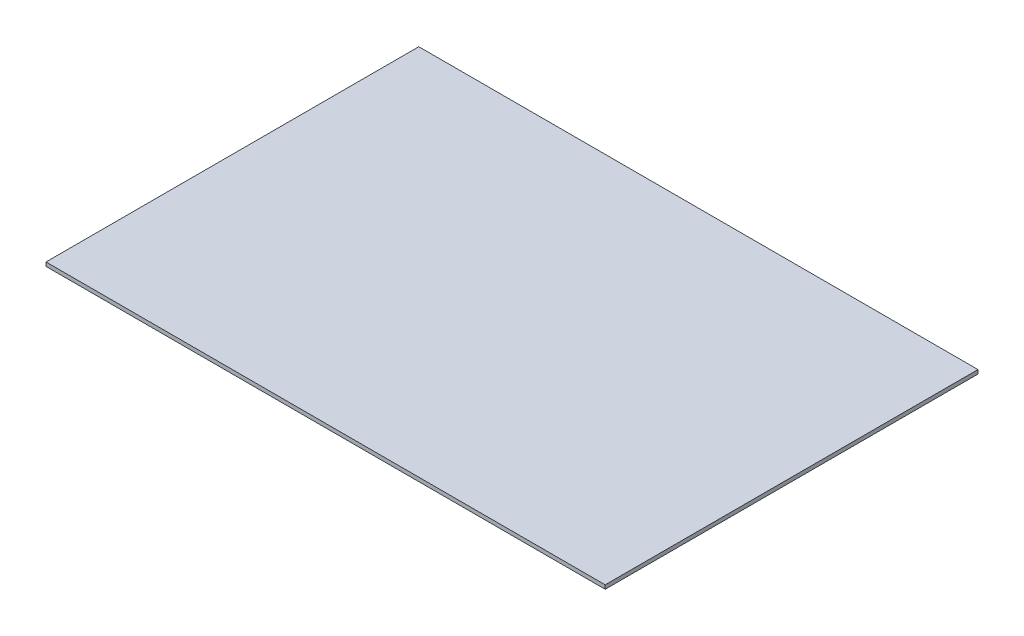
ISO-10303-21;
HEADER;
FILE_DESCRIPTION(('STEP AP214'),'2;1');
FILE_NAME('part.step','',(''),(''),'','','');
FILE_SCHEMA(('AUTOMOTIVE_DESIGN { 1 0 10303 214 1 1 1 1 }'));
ENDSEC;
DATA;
#1=APPLICATION_CONTEXT('core data for automotive mechanical design processes');
#2=APPLICATION_PROTOCOL_DEFINITION('international standard','automotive_design',2000,#1);
#3=PRODUCT_CONTEXT('',#1,'mechanical');
#4=PRODUCT('Part','Part','',(#3));
#5=PRODUCT_RELATED_PRODUCT_CATEGORY('part','',(#4));
#6=PRODUCT_DEFINITION_FORMATION('','',#4);
#7=PRODUCT_DEFINITION_CONTEXT('part definition',#1,'design');
#8=PRODUCT_DEFINITION('design','',#6,#7);
#9=PRODUCT_DEFINITION_SHAPE('','',#8);
#10=(LENGTH_UNIT() NAMED_UNIT(*) SI_UNIT(.MILLI.,.METRE.));
#11=(NAMED_UNIT(*) PLANE_ANGLE_UNIT() SI_UNIT($,.RADIAN.));
#12=(NAMED_UNIT(*) SI_UNIT($,.STERADIAN.) SOLID_ANGLE_UNIT());
#13=UNCERTAINTY_MEASURE_WITH_UNIT(LENGTH_MEASURE(1.E-05),#10,'distance_accuracy_value','');
#14=(GEOMETRIC_REPRESENTATION_CONTEXT(3) GLOBAL_UNCERTAINTY_ASSIGNED_CONTEXT((#13)) GLOBAL_UNIT_ASSIGNED_CONTEXT((#10,
#11,#12)) REPRESENTATION_CONTEXT('',''));
#15=CARTESIAN_POINT('',(0.,0.,0.));
#16=DIRECTION('',(0.,0.,1.));
#17=DIRECTION('',(1.,0.,0.));
#18=AXIS2_PLACEMENT_3D('',#15,#16,#17);
#19=CARTESIAN_POINT('',(228.6,3.175,152.4));
#20=DIRECTION('',(-1.,0.,0.));
#21=DIRECTION('',(0.,0.,1.));
#22=AXIS2_PLACEMENT_3D('',#19,#20,#21);
#23=PLANE('',#22);
#24=DIRECTION('',(0.,0.,-1.));
#25=VECTOR('',#24,1.);
#26=CARTESIAN_POINT('',(228.6,0.,152.4));
#27=LINE('',#26,#25);
#28=CARTESIAN_POINT('',(228.6,0.,152.4));
#29=VERTEX_POINT('',#28);
#30=CARTESIAN_POINT('',(228.6,0.,-152.4));
#31=VERTEX_POINT('',#30);
#32=EDGE_CURVE('E96',#29,#31,#27,.T.);
#33=ORIENTED_EDGE('',*,*,#32,.T.);
#34=DIRECTION('',(0.,-1.,0.));
#35=VECTOR('',#34,1.);
#36=CARTESIAN_POINT('',(228.6,3.175,-152.4));
#37=LINE('',#36,#35);
#38=CARTESIAN_POINT('',(228.6,3.175,-152.4));
#39=VERTEX_POINT('',#38);
#40=EDGE_CURVE('E11',#39,#31,#37,.T.);
#41=ORIENTED_EDGE('',*,*,#40,.F.);
#42=DIRECTION('',(0.,0.,-1.));
#43=VECTOR('',#42,1.);
#44=CARTESIAN_POINT('',(228.6,3.175,152.4));
#45=LINE('',#44,#43);
#46=CARTESIAN_POINT('',(228.6,3.175,152.4));
#47=VERTEX_POINT('',#46);
#48=EDGE_CURVE('E84',#47,#39,#45,.T.);
#49=ORIENTED_EDGE('',*,*,#48,.F.);
#50=DIRECTION('',(0.,-1.,0.));
#51=VECTOR('',#50,1.);
#52=CARTESIAN_POINT('',(228.6,3.175,152.4));
#53=LINE('',#52,#51);
#54=EDGE_CURVE('E92',#47,#29,#53,.T.);
#55=ORIENTED_EDGE('',*,*,#54,.T.);
#56=EDGE_LOOP('',(#33,#41,#49,#55));
#57=FACE_BOUND('',#56,.T.);
#58=ADVANCED_FACE('F33',(#57),#23,.F.);
#59=CARTESIAN_POINT('',(-228.6,3.175,-152.4));
#60=DIRECTION('',(0.,0.,1.));
#61=DIRECTION('',(1.,0.,0.));
#62=AXIS2_PLACEMENT_3D('',#59,#60,#61);
#63=PLANE('',#62);
#64=DIRECTION('',(-1.,0.,0.));
#65=VECTOR('',#64,1.);
#66=CARTESIAN_POINT('',(-228.6,0.,-152.4));
#67=LINE('',#66,#65);
#68=CARTESIAN_POINT('',(-228.6,0.,-152.4));
#69=VERTEX_POINT('',#68);
#70=EDGE_CURVE('E88',#31,#69,#67,.T.);
#71=ORIENTED_EDGE('',*,*,#70,.T.);
#72=DIRECTION('',(0.,-1.,0.));
#73=VECTOR('',#72,1.);
#74=CARTESIAN_POINT('',(-228.6,3.175,-152.4));
#75=LINE('',#74,#73);
#76=CARTESIAN_POINT('',(-228.6,3.175,-152.4));
#77=VERTEX_POINT('',#76);
#78=EDGE_CURVE('E41',#77,#69,#75,.T.);
#79=ORIENTED_EDGE('',*,*,#78,.F.);
#80=DIRECTION('',(-1.,0.,0.));
#81=VECTOR('',#80,1.);
#82=CARTESIAN_POINT('',(-228.6,3.175,-152.4));
#83=LINE('',#82,#81);
#84=EDGE_CURVE('E79',#39,#77,#83,.T.);
#85=ORIENTED_EDGE('',*,*,#84,.F.);
#86=ORIENTED_EDGE('',*,*,#40,.T.);
#87=EDGE_LOOP('',(#71,#79,#85,#86));
#88=FACE_BOUND('',#87,.T.);
#89=ADVANCED_FACE('F87',(#88),#63,.F.);
#90=CARTESIAN_POINT('',(-228.6,3.175,152.4));
#91=DIRECTION('',(1.,0.,0.));
#92=DIRECTION('',(0.,0.,-1.));
#93=AXIS2_PLACEMENT_3D('',#90,#91,#92);
#94=PLANE('',#93);
#95=DIRECTION('',(0.,0.,1.));
#96=VECTOR('',#95,1.);
#97=CARTESIAN_POINT('',(-228.6,0.,152.4));
#98=LINE('',#97,#96);
#99=CARTESIAN_POINT('',(-228.6,0.,152.4));
#100=VERTEX_POINT('',#99);
#101=EDGE_CURVE('E66',#69,#100,#98,.T.);
#102=ORIENTED_EDGE('',*,*,#101,.T.);
#103=DIRECTION('',(0.,-1.,0.));
#104=VECTOR('',#103,1.);
#105=CARTESIAN_POINT('',(-228.6,3.175,152.4));
#106=LINE('',#105,#104);
#107=CARTESIAN_POINT('',(-228.6,3.175,152.4));
#108=VERTEX_POINT('',#107);
#109=EDGE_CURVE('E89',#108,#100,#106,.T.);
#110=ORIENTED_EDGE('',*,*,#109,.F.);
#111=DIRECTION('',(0.,0.,1.));
#112=VECTOR('',#111,1.);
#113=CARTESIAN_POINT('',(-228.6,3.175,152.4));
#114=LINE('',#113,#112);
#115=EDGE_CURVE('E82',#77,#108,#114,.T.);
#116=ORIENTED_EDGE('',*,*,#115,.F.);
#117=ORIENTED_EDGE('',*,*,#78,.T.);
#118=EDGE_LOOP('',(#102,#110,#116,#117));
#119=FACE_BOUND('',#118,.T.);
#120=ADVANCED_FACE('F90',(#119),#94,.F.);
#121=CARTESIAN_POINT('',(-228.6,3.175,152.4));
#122=DIRECTION('',(0.,0.,-1.));
#123=DIRECTION('',(-1.,0.,0.));
#124=AXIS2_PLACEMENT_3D('',#121,#122,#123);
#125=PLANE('',#124);
#126=DIRECTION('',(1.,0.,0.));
#127=VECTOR('',#126,1.);
#128=CARTESIAN_POINT('',(-228.6,0.,152.4));
#129=LINE('',#128,#127);
#130=EDGE_CURVE('E72',#100,#29,#129,.T.);
#131=ORIENTED_EDGE('',*,*,#130,.T.);
#132=ORIENTED_EDGE('',*,*,#54,.F.);
#133=DIRECTION('',(1.,0.,0.));
#134=VECTOR('',#133,1.);
#135=CARTESIAN_POINT('',(-228.6,3.175,152.4));
#136=LINE('',#135,#134);
#137=EDGE_CURVE('E49',#108,#47,#136,.T.);
#138=ORIENTED_EDGE('',*,*,#137,.F.);
#139=ORIENTED_EDGE('',*,*,#109,.T.);
#140=EDGE_LOOP('',(#131,#132,#138,#139));
#141=FACE_BOUND('',#140,.T.);
#142=ADVANCED_FACE('F103',(#141),#125,.F.);
#143=CARTESIAN_POINT('',(0.,3.175,0.));
#144=DIRECTION('',(0.,-1.,0.));
#145=DIRECTION('',(0.,0.,-1.));
#146=AXIS2_PLACEMENT_3D('',#143,#144,#145);
#147=PLANE('',#146);
#148=ORIENTED_EDGE('',*,*,#48,.T.);
#149=ORIENTED_EDGE('',*,*,#84,.T.);
#150=ORIENTED_EDGE('',*,*,#115,.T.);
#151=ORIENTED_EDGE('',*,*,#137,.T.);
#152=EDGE_LOOP('',(#148,#149,#150,#151));
#153=FACE_BOUND('',#152,.T.);
#154=ADVANCED_FACE('F80',(#153),#147,.F.);
#155=CARTESIAN_POINT('',(0.,0.,0.));
#156=DIRECTION('',(0.,-1.,0.));
#157=DIRECTION('',(0.,0.,-1.));
#158=AXIS2_PLACEMENT_3D('',#155,#156,#157);
#159=PLANE('',#158);
#160=ORIENTED_EDGE('',*,*,#32,.F.);
#161=ORIENTED_EDGE('',*,*,#130,.F.);
#162=ORIENTED_EDGE('',*,*,#101,.F.);
#163=ORIENTED_EDGE('',*,*,#70,.F.);
#164=EDGE_LOOP('',(#160,#161,#162,#163));
#165=FACE_BOUND('',#164,.T.);
#166=ADVANCED_FACE('F106',(#165),#159,.T.);
#167=CLOSED_SHELL('',(#58,#89,#120,#142,#154,#166));
#168=MANIFOLD_SOLID_BREP('B2',#167);
#169=ADVANCED_BREP_SHAPE_REPRESENTATION('',(#18,#168),#14);
#170=SHAPE_DEFINITION_REPRESENTATION(#9,#169);
ENDSEC;
END-ISO-10303-21;
